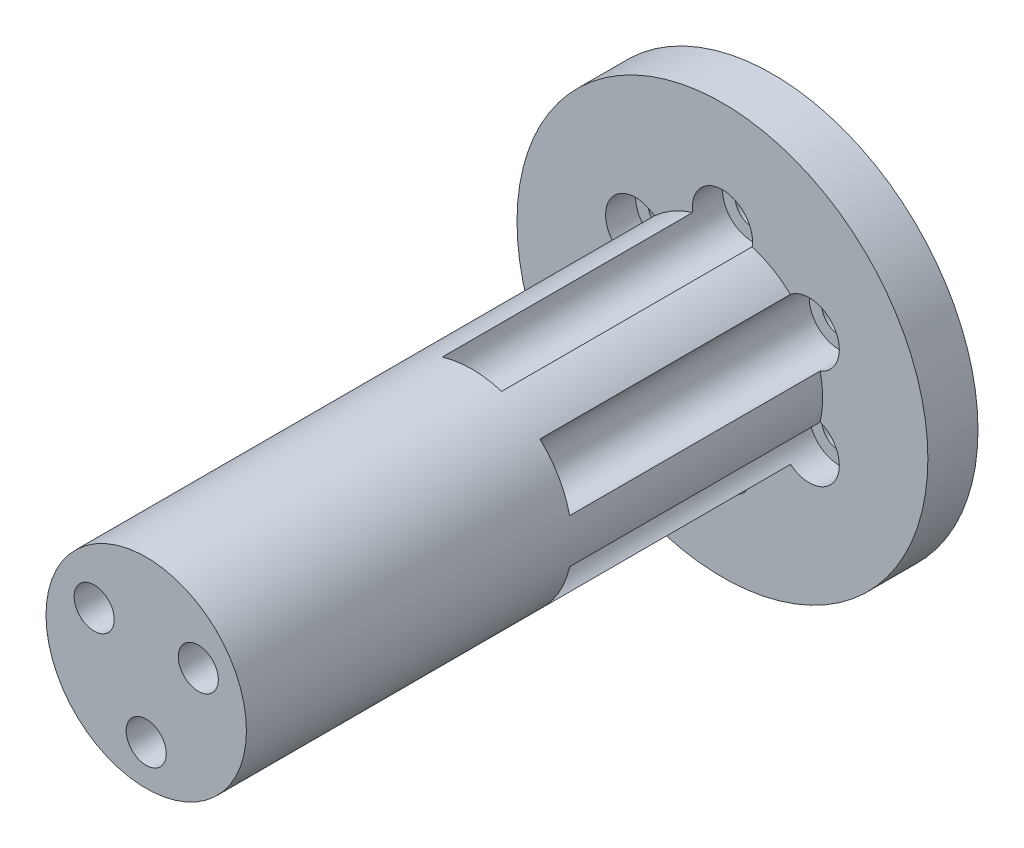
ISO-10303-21;
HEADER;
FILE_DESCRIPTION(('STEP AP214'),'2;1');
FILE_NAME('part.step','',(''),(''),'','','');
FILE_SCHEMA(('AUTOMOTIVE_DESIGN { 1 0 10303 214 1 1 1 1 }'));
ENDSEC;
DATA;
#1=APPLICATION_CONTEXT('core data for automotive mechanical design processes');
#2=APPLICATION_PROTOCOL_DEFINITION('international standard','automotive_design',2000,#1);
#3=PRODUCT_CONTEXT('',#1,'mechanical');
#4=PRODUCT('Part','Part','',(#3));
#5=PRODUCT_RELATED_PRODUCT_CATEGORY('part','',(#4));
#6=PRODUCT_DEFINITION_FORMATION('','',#4);
#7=PRODUCT_DEFINITION_CONTEXT('part definition',#1,'design');
#8=PRODUCT_DEFINITION('design','',#6,#7);
#9=PRODUCT_DEFINITION_SHAPE('','',#8);
#10=(LENGTH_UNIT() NAMED_UNIT(*) SI_UNIT(.MILLI.,.METRE.));
#11=(NAMED_UNIT(*) PLANE_ANGLE_UNIT() SI_UNIT($,.RADIAN.));
#12=(NAMED_UNIT(*) SI_UNIT($,.STERADIAN.) SOLID_ANGLE_UNIT());
#13=UNCERTAINTY_MEASURE_WITH_UNIT(LENGTH_MEASURE(1.E-05),#10,'distance_accuracy_value','');
#14=(GEOMETRIC_REPRESENTATION_CONTEXT(3) GLOBAL_UNCERTAINTY_ASSIGNED_CONTEXT((#13)) GLOBAL_UNIT_ASSIGNED_CONTEXT((#10,
#11,#12)) REPRESENTATION_CONTEXT('',''));
#15=CARTESIAN_POINT('',(0.,0.,0.));
#16=DIRECTION('',(0.,0.,1.));
#17=DIRECTION('',(1.,0.,0.));
#18=AXIS2_PLACEMENT_3D('',#15,#16,#17);
#19=CARTESIAN_POINT('',(-5.19615242270663,3.,46.9));
#20=DIRECTION('',(0.,0.,1.));
#21=DIRECTION('',(1.,0.,0.));
#22=AXIS2_PLACEMENT_3D('',#19,#20,#21);
#23=CYLINDRICAL_SURFACE('',#22,2.);
#24=CARTESIAN_POINT('',(-5.19615242270663,3.,56.5));
#25=DIRECTION('',(0.,0.,1.));
#26=DIRECTION('',(1.,0.,0.));
#27=AXIS2_PLACEMENT_3D('',#24,#25,#26);
#28=CIRCLE('',#27,2.);
#29=CARTESIAN_POINT('',(-3.19615242270663,3.,56.5));
#30=VERTEX_POINT('',#29);
#31=EDGE_CURVE('E314',#30,#30,#28,.T.);
#32=ORIENTED_EDGE('',*,*,#31,.T.);
#33=EDGE_LOOP('',(#32));
#34=FACE_BOUND('',#33,.T.);
#35=CARTESIAN_POINT('',(-5.19615242270663,3.,48.9));
#36=DIRECTION('',(0.,0.,1.));
#37=DIRECTION('',(1.,0.,0.));
#38=AXIS2_PLACEMENT_3D('',#35,#36,#37);
#39=CIRCLE('',#38,2.);
#40=CARTESIAN_POINT('',(-3.19615242270663,3.,48.9));
#41=VERTEX_POINT('',#40);
#42=EDGE_CURVE('E11',#41,#41,#39,.T.);
#43=ORIENTED_EDGE('',*,*,#42,.F.);
#44=EDGE_LOOP('',(#43));
#45=FACE_BOUND('',#44,.T.);
#46=ADVANCED_FACE('F17',(#34,#45),#23,.F.);
#47=CARTESIAN_POINT('',(0.,0.,48.9));
#48=DIRECTION('',(0.,0.,1.));
#49=DIRECTION('',(1.,0.,0.));
#50=AXIS2_PLACEMENT_3D('',#47,#48,#49);
#51=PLANE('',#50);
#52=ORIENTED_EDGE('',*,*,#42,.T.);
#53=EDGE_LOOP('',(#52));
#54=FACE_BOUND('',#53,.T.);
#55=ADVANCED_FACE('F487',(#54),#51,.T.);
#56=CARTESIAN_POINT('',(5.19615242270663,3.,46.9));
#57=DIRECTION('',(0.,0.,1.));
#58=DIRECTION('',(1.,0.,0.));
#59=AXIS2_PLACEMENT_3D('',#56,#57,#58);
#60=CYLINDRICAL_SURFACE('',#59,2.);
#61=CARTESIAN_POINT('',(5.19615242270663,3.,56.5));
#62=DIRECTION('',(0.,0.,1.));
#63=DIRECTION('',(1.,0.,0.));
#64=AXIS2_PLACEMENT_3D('',#61,#62,#63);
#65=CIRCLE('',#64,2.);
#66=CARTESIAN_POINT('',(7.19615242270663,3.,56.5));
#67=VERTEX_POINT('',#66);
#68=EDGE_CURVE('E310',#67,#67,#65,.T.);
#69=ORIENTED_EDGE('',*,*,#68,.T.);
#70=EDGE_LOOP('',(#69));
#71=FACE_BOUND('',#70,.T.);
#72=CARTESIAN_POINT('',(5.19615242270663,3.,48.9));
#73=DIRECTION('',(0.,0.,1.));
#74=DIRECTION('',(1.,0.,0.));
#75=AXIS2_PLACEMENT_3D('',#72,#73,#74);
#76=CIRCLE('',#75,2.);
#77=CARTESIAN_POINT('',(7.19615242270663,3.,48.9));
#78=VERTEX_POINT('',#77);
#79=EDGE_CURVE('E28',#78,#78,#76,.T.);
#80=ORIENTED_EDGE('',*,*,#79,.F.);
#81=EDGE_LOOP('',(#80));
#82=FACE_BOUND('',#81,.T.);
#83=ADVANCED_FACE('F493',(#71,#82),#60,.F.);
#84=CARTESIAN_POINT('',(0.,0.,48.9));
#85=DIRECTION('',(0.,0.,1.));
#86=DIRECTION('',(1.,0.,0.));
#87=AXIS2_PLACEMENT_3D('',#84,#85,#86);
#88=PLANE('',#87);
#89=ORIENTED_EDGE('',*,*,#79,.T.);
#90=EDGE_LOOP('',(#89));
#91=FACE_BOUND('',#90,.T.);
#92=ADVANCED_FACE('F593',(#91),#88,.T.);
#93=CARTESIAN_POINT('',(0.,-6.,46.9));
#94=DIRECTION('',(0.,0.,1.));
#95=DIRECTION('',(1.,0.,0.));
#96=AXIS2_PLACEMENT_3D('',#93,#94,#95);
#97=CYLINDRICAL_SURFACE('',#96,2.);
#98=CARTESIAN_POINT('',(0.,-6.,56.5));
#99=DIRECTION('',(0.,0.,1.));
#100=DIRECTION('',(1.,0.,0.));
#101=AXIS2_PLACEMENT_3D('',#98,#99,#100);
#102=CIRCLE('',#101,2.);
#103=CARTESIAN_POINT('',(2.,-6.,56.5));
#104=VERTEX_POINT('',#103);
#105=EDGE_CURVE('E302',#104,#104,#102,.T.);
#106=ORIENTED_EDGE('',*,*,#105,.T.);
#107=EDGE_LOOP('',(#106));
#108=FACE_BOUND('',#107,.T.);
#109=CARTESIAN_POINT('',(0.,-6.,48.9));
#110=DIRECTION('',(0.,0.,1.));
#111=DIRECTION('',(1.,0.,0.));
#112=AXIS2_PLACEMENT_3D('',#109,#110,#111);
#113=CIRCLE('',#112,2.);
#114=CARTESIAN_POINT('',(2.,-6.,48.9));
#115=VERTEX_POINT('',#114);
#116=EDGE_CURVE('E296',#115,#115,#113,.T.);
#117=ORIENTED_EDGE('',*,*,#116,.F.);
#118=EDGE_LOOP('',(#117));
#119=FACE_BOUND('',#118,.T.);
#120=ADVANCED_FACE('F589',(#108,#119),#97,.F.);
#121=CARTESIAN_POINT('',(0.,0.,48.9));
#122=DIRECTION('',(0.,0.,1.));
#123=DIRECTION('',(1.,0.,0.));
#124=AXIS2_PLACEMENT_3D('',#121,#122,#123);
#125=PLANE('',#124);
#126=ORIENTED_EDGE('',*,*,#116,.T.);
#127=EDGE_LOOP('',(#126));
#128=FACE_BOUND('',#127,.T.);
#129=ADVANCED_FACE('F592',(#128),#125,.T.);
#130=CARTESIAN_POINT('',(68.5000000000137,0.,56.5));
#131=DIRECTION('',(0.,0.,1.));
#132=DIRECTION('',(1.,0.,0.));
#133=AXIS2_PLACEMENT_3D('',#130,#131,#132);
#134=PLANE('',#133);
#135=CARTESIAN_POINT('',(0.,0.,56.5));
#136=DIRECTION('',(0.,0.,1.));
#137=DIRECTION('',(1.,0.,0.));
#138=AXIS2_PLACEMENT_3D('',#135,#136,#137);
#139=CIRCLE('',#138,10.);
#140=CARTESIAN_POINT('',(10.,0.,56.5));
#141=VERTEX_POINT('',#140);
#142=EDGE_CURVE('E237',#141,#141,#139,.T.);
#143=ORIENTED_EDGE('',*,*,#142,.T.);
#144=EDGE_LOOP('',(#143));
#145=FACE_BOUND('',#144,.T.);
#146=ORIENTED_EDGE('',*,*,#105,.F.);
#147=EDGE_LOOP('',(#146));
#148=FACE_BOUND('',#147,.T.);
#149=ORIENTED_EDGE('',*,*,#68,.F.);
#150=EDGE_LOOP('',(#149));
#151=FACE_BOUND('',#150,.T.);
#152=ORIENTED_EDGE('',*,*,#31,.F.);
#153=EDGE_LOOP('',(#152));
#154=FACE_BOUND('',#153,.T.);
#155=ADVANCED_FACE('F597',(#145,#148,#151,#154),#134,.T.);
#156=CARTESIAN_POINT('',(0.,0.,24.));
#157=DIRECTION('',(0.,0.,1.));
#158=DIRECTION('',(1.,0.,0.));
#159=AXIS2_PLACEMENT_3D('',#156,#157,#158);
#160=PLANE('',#159);
#161=CARTESIAN_POINT('',(0.,0.,24.));
#162=DIRECTION('',(0.,0.,1.));
#163=DIRECTION('',(1.,0.,0.));
#164=AXIS2_PLACEMENT_3D('',#161,#162,#163);
#165=CIRCLE('',#164,10.);
#166=CARTESIAN_POINT('',(-6.787513611145,7.34368156843156,24.));
#167=VERTEX_POINT('',#166);
#168=CARTESIAN_POINT('',(-9.75357160113778,2.20631843156845,24.));
#169=VERTEX_POINT('',#168);
#170=EDGE_CURVE('E21',#167,#169,#165,.T.);
#171=ORIENTED_EDGE('',*,*,#170,.F.);
#172=CARTESIAN_POINT('',(-8.66025403784439,5.,24.));
#173=DIRECTION('',(0.,0.,1.));
#174=DIRECTION('',(1.,0.,0.));
#175=AXIS2_PLACEMENT_3D('',#172,#173,#174);
#176=CIRCLE('',#175,3.);
#177=EDGE_CURVE('E252',#169,#167,#176,.T.);
#178=ORIENTED_EDGE('',*,*,#177,.F.);
#179=EDGE_LOOP('',(#171,#178));
#180=FACE_BOUND('',#179,.T.);
#181=ADVANCED_FACE('F598',(#180),#160,.F.);
#182=CARTESIAN_POINT('',(0.,0.,24.));
#183=DIRECTION('',(0.,0.,1.));
#184=DIRECTION('',(1.,0.,0.));
#185=AXIS2_PLACEMENT_3D('',#182,#183,#184);
#186=PLANE('',#185);
#187=CARTESIAN_POINT('',(0.,0.,24.));
#188=DIRECTION('',(0.,0.,1.));
#189=DIRECTION('',(1.,0.,0.));
#190=AXIS2_PLACEMENT_3D('',#187,#188,#189);
#191=CIRCLE('',#190,10.);
#192=CARTESIAN_POINT('',(-9.75357160113778,-2.20631843156845,24.));
#193=VERTEX_POINT('',#192);
#194=CARTESIAN_POINT('',(-6.787513611145,-7.34368156843156,24.));
#195=VERTEX_POINT('',#194);
#196=EDGE_CURVE('E283',#193,#195,#191,.T.);
#197=ORIENTED_EDGE('',*,*,#196,.F.);
#198=CARTESIAN_POINT('',(-8.66025403784439,-5.,24.));
#199=DIRECTION('',(0.,0.,1.));
#200=DIRECTION('',(1.,0.,0.));
#201=AXIS2_PLACEMENT_3D('',#198,#199,#200);
#202=CIRCLE('',#201,3.);
#203=EDGE_CURVE('E279',#195,#193,#202,.T.);
#204=ORIENTED_EDGE('',*,*,#203,.F.);
#205=EDGE_LOOP('',(#197,#204));
#206=FACE_BOUND('',#205,.T.);
#207=ADVANCED_FACE('F600',(#206),#186,.F.);
#208=CARTESIAN_POINT('',(0.,0.,24.));
#209=DIRECTION('',(0.,0.,1.));
#210=DIRECTION('',(1.,0.,0.));
#211=AXIS2_PLACEMENT_3D('',#208,#209,#210);
#212=PLANE('',#211);
#213=CARTESIAN_POINT('',(0.,0.,24.));
#214=DIRECTION('',(0.,0.,1.));
#215=DIRECTION('',(1.,0.,0.));
#216=AXIS2_PLACEMENT_3D('',#213,#214,#215);
#217=CIRCLE('',#216,10.);
#218=CARTESIAN_POINT('',(-2.96605798999278,-9.55,24.));
#219=VERTEX_POINT('',#218);
#220=CARTESIAN_POINT('',(2.96605798999278,-9.55,24.));
#221=VERTEX_POINT('',#220);
#222=EDGE_CURVE('E439',#219,#221,#217,.T.);
#223=ORIENTED_EDGE('',*,*,#222,.F.);
#224=CARTESIAN_POINT('',(0.,-10.,24.));
#225=DIRECTION('',(0.,0.,1.));
#226=DIRECTION('',(1.,0.,0.));
#227=AXIS2_PLACEMENT_3D('',#224,#225,#226);
#228=CIRCLE('',#227,3.);
#229=EDGE_CURVE('E365',#221,#219,#228,.T.);
#230=ORIENTED_EDGE('',*,*,#229,.F.);
#231=EDGE_LOOP('',(#223,#230));
#232=FACE_BOUND('',#231,.T.);
#233=ADVANCED_FACE('F603',(#232),#212,.F.);
#234=CARTESIAN_POINT('',(0.,0.,24.));
#235=DIRECTION('',(0.,0.,1.));
#236=DIRECTION('',(1.,0.,0.));
#237=AXIS2_PLACEMENT_3D('',#234,#235,#236);
#238=PLANE('',#237);
#239=CARTESIAN_POINT('',(0.,0.,24.));
#240=DIRECTION('',(0.,0.,1.));
#241=DIRECTION('',(1.,0.,0.));
#242=AXIS2_PLACEMENT_3D('',#239,#240,#241);
#243=CIRCLE('',#242,10.);
#244=CARTESIAN_POINT('',(6.787513611145,-7.34368156843155,24.));
#245=VERTEX_POINT('',#244);
#246=CARTESIAN_POINT('',(9.75357160113778,-2.20631843156844,24.));
#247=VERTEX_POINT('',#246);
#248=EDGE_CURVE('E291',#245,#247,#243,.T.);
#249=ORIENTED_EDGE('',*,*,#248,.F.);
#250=CARTESIAN_POINT('',(8.66025403784439,-5.,24.));
#251=DIRECTION('',(0.,0.,1.));
#252=DIRECTION('',(1.,0.,0.));
#253=AXIS2_PLACEMENT_3D('',#250,#251,#252);
#254=CIRCLE('',#253,3.);
#255=EDGE_CURVE('E236',#247,#245,#254,.T.);
#256=ORIENTED_EDGE('',*,*,#255,.F.);
#257=EDGE_LOOP('',(#249,#256));
#258=FACE_BOUND('',#257,.T.);
#259=ADVANCED_FACE('F606',(#258),#238,.F.);
#260=CARTESIAN_POINT('',(0.,0.,24.));
#261=DIRECTION('',(0.,0.,1.));
#262=DIRECTION('',(1.,0.,0.));
#263=AXIS2_PLACEMENT_3D('',#260,#261,#262);
#264=PLANE('',#263);
#265=CARTESIAN_POINT('',(0.,0.,24.));
#266=DIRECTION('',(0.,0.,1.));
#267=DIRECTION('',(1.,0.,0.));
#268=AXIS2_PLACEMENT_3D('',#265,#266,#267);
#269=CIRCLE('',#268,10.);
#270=CARTESIAN_POINT('',(9.75357160113778,2.20631843156845,24.));
#271=VERTEX_POINT('',#270);
#272=CARTESIAN_POINT('',(6.787513611145,7.34368156843156,24.));
#273=VERTEX_POINT('',#272);
#274=EDGE_CURVE('E259',#271,#273,#269,.T.);
#275=ORIENTED_EDGE('',*,*,#274,.F.);
#276=CARTESIAN_POINT('',(8.66025403784439,5.,24.));
#277=DIRECTION('',(0.,0.,1.));
#278=DIRECTION('',(1.,0.,0.));
#279=AXIS2_PLACEMENT_3D('',#276,#277,#278);
#280=CIRCLE('',#279,3.);
#281=EDGE_CURVE('E278',#273,#271,#280,.T.);
#282=ORIENTED_EDGE('',*,*,#281,.F.);
#283=EDGE_LOOP('',(#275,#282));
#284=FACE_BOUND('',#283,.T.);
#285=ADVANCED_FACE('F567',(#284),#264,.F.);
#286=CARTESIAN_POINT('',(0.,0.,24.));
#287=DIRECTION('',(0.,0.,1.));
#288=DIRECTION('',(1.,0.,0.));
#289=AXIS2_PLACEMENT_3D('',#286,#287,#288);
#290=PLANE('',#289);
#291=CARTESIAN_POINT('',(0.,0.,24.));
#292=DIRECTION('',(0.,0.,1.));
#293=DIRECTION('',(1.,0.,0.));
#294=AXIS2_PLACEMENT_3D('',#291,#292,#293);
#295=CIRCLE('',#294,10.);
#296=CARTESIAN_POINT('',(2.96605798999278,9.55,24.));
#297=VERTEX_POINT('',#296);
#298=CARTESIAN_POINT('',(-2.96605798999278,9.55,24.));
#299=VERTEX_POINT('',#298);
#300=EDGE_CURVE('E329',#297,#299,#295,.T.);
#301=ORIENTED_EDGE('',*,*,#300,.F.);
#302=CARTESIAN_POINT('',(0.,10.,24.));
#303=DIRECTION('',(0.,0.,1.));
#304=DIRECTION('',(1.,0.,0.));
#305=AXIS2_PLACEMENT_3D('',#302,#303,#304);
#306=CIRCLE('',#305,3.);
#307=EDGE_CURVE('E266',#299,#297,#306,.T.);
#308=ORIENTED_EDGE('',*,*,#307,.F.);
#309=EDGE_LOOP('',(#301,#308));
#310=FACE_BOUND('',#309,.T.);
#311=ADVANCED_FACE('F563',(#310),#290,.F.);
#312=CARTESIAN_POINT('',(8.66025403784439,5.,-4.));
#313=DIRECTION('',(0.,0.,1.));
#314=DIRECTION('',(1.,0.,0.));
#315=AXIS2_PLACEMENT_3D('',#312,#313,#314);
#316=CYLINDRICAL_SURFACE('',#315,3.);
#317=CARTESIAN_POINT('',(8.66025403784439,5.,-1.));
#318=DIRECTION('',(0.,0.,1.));
#319=DIRECTION('',(1.,0.,0.));
#320=AXIS2_PLACEMENT_3D('',#317,#318,#319);
#321=CIRCLE('',#320,3.);
#322=CARTESIAN_POINT('',(9.75357160113778,2.20631843156845,-1.));
#323=VERTEX_POINT('',#322);
#324=CARTESIAN_POINT('',(6.787513611145,7.34368156843156,-1.));
#325=VERTEX_POINT('',#324);
#326=EDGE_CURVE('E337',#323,#325,#321,.T.);
#327=ORIENTED_EDGE('',*,*,#326,.T.);
#328=DIRECTION('',(0.,0.,-1.));
#329=VECTOR('',#328,1.);
#330=CARTESIAN_POINT('',(6.787513611145,7.34368156843156,24.));
#331=LINE('',#330,#329);
#332=EDGE_CURVE('E330',#273,#325,#331,.T.);
#333=ORIENTED_EDGE('',*,*,#332,.F.);
#334=ORIENTED_EDGE('',*,*,#281,.T.);
#335=DIRECTION('',(0.,0.,-1.));
#336=VECTOR('',#335,1.);
#337=CARTESIAN_POINT('',(9.75357160113778,2.20631843156845,24.));
#338=LINE('',#337,#336);
#339=EDGE_CURVE('E256',#271,#323,#338,.T.);
#340=ORIENTED_EDGE('',*,*,#339,.T.);
#341=EDGE_LOOP('',(#327,#333,#334,#340));
#342=FACE_BOUND('',#341,.T.);
#343=CARTESIAN_POINT('',(8.66025403784439,5.,-4.));
#344=DIRECTION('',(0.,0.,1.));
#345=DIRECTION('',(1.,0.,0.));
#346=AXIS2_PLACEMENT_3D('',#343,#344,#345);
#347=CIRCLE('',#346,3.);
#348=CARTESIAN_POINT('',(11.6602540378444,5.,-4.));
#349=VERTEX_POINT('',#348);
#350=EDGE_CURVE('E270',#349,#349,#347,.T.);
#351=ORIENTED_EDGE('',*,*,#350,.F.);
#352=EDGE_LOOP('',(#351));
#353=FACE_BOUND('',#352,.T.);
#354=ADVANCED_FACE('F566',(#342,#353),#316,.F.);
#355=CARTESIAN_POINT('',(0.,0.,-4.));
#356=DIRECTION('',(0.,0.,1.));
#357=DIRECTION('',(1.,0.,0.));
#358=AXIS2_PLACEMENT_3D('',#355,#356,#357);
#359=PLANE('',#358);
#360=CARTESIAN_POINT('',(8.66025403784439,5.,-4.));
#361=DIRECTION('',(0.,0.,-1.));
#362=DIRECTION('',(1.,0.,0.));
#363=AXIS2_PLACEMENT_3D('',#360,#361,#362);
#364=CIRCLE('',#363,1.75);
#365=CARTESIAN_POINT('',(10.4102540378444,5.,-4.));
#366=VERTEX_POINT('',#365);
#367=EDGE_CURVE('E345',#366,#366,#364,.T.);
#368=ORIENTED_EDGE('',*,*,#367,.T.);
#369=EDGE_LOOP('',(#368));
#370=FACE_BOUND('',#369,.T.);
#371=ORIENTED_EDGE('',*,*,#350,.T.);
#372=EDGE_LOOP('',(#371));
#373=FACE_BOUND('',#372,.T.);
#374=ADVANCED_FACE('F510',(#370,#373),#359,.T.);
#375=CARTESIAN_POINT('',(0.,10.,-4.));
#376=DIRECTION('',(0.,0.,1.));
#377=DIRECTION('',(1.,0.,0.));
#378=AXIS2_PLACEMENT_3D('',#375,#376,#377);
#379=CYLINDRICAL_SURFACE('',#378,3.);
#380=CARTESIAN_POINT('',(0.,10.,-1.));
#381=DIRECTION('',(0.,0.,1.));
#382=DIRECTION('',(1.,0.,0.));
#383=AXIS2_PLACEMENT_3D('',#380,#381,#382);
#384=CIRCLE('',#383,3.);
#385=CARTESIAN_POINT('',(2.96605798999278,9.55,-1.));
#386=VERTEX_POINT('',#385);
#387=CARTESIAN_POINT('',(-2.96605798999278,9.55,-1.));
#388=VERTEX_POINT('',#387);
#389=EDGE_CURVE('E359',#386,#388,#384,.T.);
#390=ORIENTED_EDGE('',*,*,#389,.T.);
#391=DIRECTION('',(0.,0.,-1.));
#392=VECTOR('',#391,1.);
#393=CARTESIAN_POINT('',(-2.96605798999278,9.55,24.));
#394=LINE('',#393,#392);
#395=EDGE_CURVE('E355',#299,#388,#394,.T.);
#396=ORIENTED_EDGE('',*,*,#395,.F.);
#397=ORIENTED_EDGE('',*,*,#307,.T.);
#398=DIRECTION('',(0.,0.,-1.));
#399=VECTOR('',#398,1.);
#400=CARTESIAN_POINT('',(2.96605798999278,9.55,24.));
#401=LINE('',#400,#399);
#402=EDGE_CURVE('E326',#297,#386,#401,.T.);
#403=ORIENTED_EDGE('',*,*,#402,.T.);
#404=EDGE_LOOP('',(#390,#396,#397,#403));
#405=FACE_BOUND('',#404,.T.);
#406=CARTESIAN_POINT('',(0.,10.,-4.));
#407=DIRECTION('',(0.,0.,1.));
#408=DIRECTION('',(1.,0.,0.));
#409=AXIS2_PLACEMENT_3D('',#406,#407,#408);
#410=CIRCLE('',#409,3.);
#411=CARTESIAN_POINT('',(3.,10.,-4.));
#412=VERTEX_POINT('',#411);
#413=EDGE_CURVE('E254',#412,#412,#410,.T.);
#414=ORIENTED_EDGE('',*,*,#413,.F.);
#415=EDGE_LOOP('',(#414));
#416=FACE_BOUND('',#415,.T.);
#417=ADVANCED_FACE('F501',(#405,#416),#379,.F.);
#418=CARTESIAN_POINT('',(0.,0.,-4.));
#419=DIRECTION('',(0.,0.,1.));
#420=DIRECTION('',(1.,0.,0.));
#421=AXIS2_PLACEMENT_3D('',#418,#419,#420);
#422=PLANE('',#421);
#423=CARTESIAN_POINT('',(0.,10.,-4.));
#424=DIRECTION('',(0.,0.,-1.));
#425=DIRECTION('',(1.,0.,0.));
#426=AXIS2_PLACEMENT_3D('',#423,#424,#425);
#427=CIRCLE('',#426,1.75);
#428=CARTESIAN_POINT('',(1.75,10.,-4.));
#429=VERTEX_POINT('',#428);
#430=EDGE_CURVE('E261',#429,#429,#427,.T.);
#431=ORIENTED_EDGE('',*,*,#430,.T.);
#432=EDGE_LOOP('',(#431));
#433=FACE_BOUND('',#432,.T.);
#434=ORIENTED_EDGE('',*,*,#413,.T.);
#435=EDGE_LOOP('',(#434));
#436=FACE_BOUND('',#435,.T.);
#437=ADVANCED_FACE('F498',(#433,#436),#422,.T.);
#438=CARTESIAN_POINT('',(-8.66025403784439,5.,-4.));
#439=DIRECTION('',(0.,0.,1.));
#440=DIRECTION('',(1.,0.,0.));
#441=AXIS2_PLACEMENT_3D('',#438,#439,#440);
#442=CYLINDRICAL_SURFACE('',#441,3.);
#443=CARTESIAN_POINT('',(-8.66025403784439,5.,-1.));
#444=DIRECTION('',(0.,0.,1.));
#445=DIRECTION('',(1.,0.,0.));
#446=AXIS2_PLACEMENT_3D('',#443,#444,#445);
#447=CIRCLE('',#446,3.);
#448=CARTESIAN_POINT('',(-6.787513611145,7.34368156843156,-1.));
#449=VERTEX_POINT('',#448);
#450=CARTESIAN_POINT('',(-9.75357160113778,2.20631843156845,-1.));
#451=VERTEX_POINT('',#450);
#452=EDGE_CURVE('E331',#449,#451,#447,.T.);
#453=ORIENTED_EDGE('',*,*,#452,.T.);
#454=DIRECTION('',(0.,0.,-1.));
#455=VECTOR('',#454,1.);
#456=CARTESIAN_POINT('',(-9.75357160113778,2.20631843156845,24.));
#457=LINE('',#456,#455);
#458=EDGE_CURVE('E398',#169,#451,#457,.T.);
#459=ORIENTED_EDGE('',*,*,#458,.F.);
#460=ORIENTED_EDGE('',*,*,#177,.T.);
#461=DIRECTION('',(0.,0.,-1.));
#462=VECTOR('',#461,1.);
#463=CARTESIAN_POINT('',(-6.787513611145,7.34368156843156,24.));
#464=LINE('',#463,#462);
#465=EDGE_CURVE('E246',#167,#449,#464,.T.);
#466=ORIENTED_EDGE('',*,*,#465,.T.);
#467=EDGE_LOOP('',(#453,#459,#460,#466));
#468=FACE_BOUND('',#467,.T.);
#469=CARTESIAN_POINT('',(-8.66025403784439,5.,-4.));
#470=DIRECTION('',(0.,0.,1.));
#471=DIRECTION('',(1.,0.,0.));
#472=AXIS2_PLACEMENT_3D('',#469,#470,#471);
#473=CIRCLE('',#472,3.);
#474=CARTESIAN_POINT('',(-5.66025403784439,5.,-4.));
#475=VERTEX_POINT('',#474);
#476=EDGE_CURVE('E255',#475,#475,#473,.T.);
#477=ORIENTED_EDGE('',*,*,#476,.F.);
#478=EDGE_LOOP('',(#477));
#479=FACE_BOUND('',#478,.T.);
#480=ADVANCED_FACE('F500',(#468,#479),#442,.F.);
#481=CARTESIAN_POINT('',(0.,0.,-4.));
#482=DIRECTION('',(0.,0.,1.));
#483=DIRECTION('',(1.,0.,0.));
#484=AXIS2_PLACEMENT_3D('',#481,#482,#483);
#485=PLANE('',#484);
#486=CARTESIAN_POINT('',(-8.66025403784439,5.,-4.));
#487=DIRECTION('',(0.,0.,-1.));
#488=DIRECTION('',(1.,0.,0.));
#489=AXIS2_PLACEMENT_3D('',#486,#487,#488);
#490=CIRCLE('',#489,1.75);
#491=CARTESIAN_POINT('',(-6.91025403784439,5.,-4.));
#492=VERTEX_POINT('',#491);
#493=EDGE_CURVE('E316',#492,#492,#490,.T.);
#494=ORIENTED_EDGE('',*,*,#493,.T.);
#495=EDGE_LOOP('',(#494));
#496=FACE_BOUND('',#495,.T.);
#497=ORIENTED_EDGE('',*,*,#476,.T.);
#498=EDGE_LOOP('',(#497));
#499=FACE_BOUND('',#498,.T.);
#500=ADVANCED_FACE('F507',(#496,#499),#485,.T.);
#501=CARTESIAN_POINT('',(-8.66025403784439,-5.,-4.));
#502=DIRECTION('',(0.,0.,1.));
#503=DIRECTION('',(1.,0.,0.));
#504=AXIS2_PLACEMENT_3D('',#501,#502,#503);
#505=CYLINDRICAL_SURFACE('',#504,3.);
#506=CARTESIAN_POINT('',(-8.66025403784439,-5.,-1.));
#507=DIRECTION('',(0.,0.,1.));
#508=DIRECTION('',(1.,0.,0.));
#509=AXIS2_PLACEMENT_3D('',#506,#507,#508);
#510=CIRCLE('',#509,3.);
#511=CARTESIAN_POINT('',(-9.75357160113778,-2.20631843156845,-1.));
#512=VERTEX_POINT('',#511);
#513=CARTESIAN_POINT('',(-6.787513611145,-7.34368156843156,-1.));
#514=VERTEX_POINT('',#513);
#515=EDGE_CURVE('E388',#512,#514,#510,.T.);
#516=ORIENTED_EDGE('',*,*,#515,.T.);
#517=DIRECTION('',(0.,0.,-1.));
#518=VECTOR('',#517,1.);
#519=CARTESIAN_POINT('',(-6.787513611145,-7.34368156843156,24.));
#520=LINE('',#519,#518);
#521=EDGE_CURVE('E287',#195,#514,#520,.T.);
#522=ORIENTED_EDGE('',*,*,#521,.F.);
#523=ORIENTED_EDGE('',*,*,#203,.T.);
#524=DIRECTION('',(0.,0.,-1.));
#525=VECTOR('',#524,1.);
#526=CARTESIAN_POINT('',(-9.75357160113778,-2.20631843156845,24.));
#527=LINE('',#526,#525);
#528=EDGE_CURVE('E288',#193,#512,#527,.T.);
#529=ORIENTED_EDGE('',*,*,#528,.T.);
#530=EDGE_LOOP('',(#516,#522,#523,#529));
#531=FACE_BOUND('',#530,.T.);
#532=CARTESIAN_POINT('',(-8.66025403784439,-5.,-4.));
#533=DIRECTION('',(0.,0.,1.));
#534=DIRECTION('',(1.,0.,0.));
#535=AXIS2_PLACEMENT_3D('',#532,#533,#534);
#536=CIRCLE('',#535,3.);
#537=CARTESIAN_POINT('',(-5.66025403784439,-5.,-4.));
#538=VERTEX_POINT('',#537);
#539=EDGE_CURVE('E282',#538,#538,#536,.T.);
#540=ORIENTED_EDGE('',*,*,#539,.F.);
#541=EDGE_LOOP('',(#540));
#542=FACE_BOUND('',#541,.T.);
#543=ADVANCED_FACE('F481',(#531,#542),#505,.F.);
#544=CARTESIAN_POINT('',(0.,0.,-4.));
#545=DIRECTION('',(0.,0.,1.));
#546=DIRECTION('',(1.,0.,0.));
#547=AXIS2_PLACEMENT_3D('',#544,#545,#546);
#548=PLANE('',#547);
#549=CARTESIAN_POINT('',(-8.66025403784439,-5.,-4.));
#550=DIRECTION('',(0.,0.,-1.));
#551=DIRECTION('',(1.,0.,0.));
#552=AXIS2_PLACEMENT_3D('',#549,#550,#551);
#553=CIRCLE('',#552,1.75);
#554=CARTESIAN_POINT('',(-6.91025403784439,-5.,-4.));
#555=VERTEX_POINT('',#554);
#556=EDGE_CURVE('E275',#555,#555,#553,.T.);
#557=ORIENTED_EDGE('',*,*,#556,.T.);
#558=EDGE_LOOP('',(#557));
#559=FACE_BOUND('',#558,.T.);
#560=ORIENTED_EDGE('',*,*,#539,.T.);
#561=EDGE_LOOP('',(#560));
#562=FACE_BOUND('',#561,.T.);
#563=ADVANCED_FACE('F471',(#559,#562),#548,.T.);
#564=CARTESIAN_POINT('',(0.,-10.,-4.));
#565=DIRECTION('',(0.,0.,1.));
#566=DIRECTION('',(1.,0.,0.));
#567=AXIS2_PLACEMENT_3D('',#564,#565,#566);
#568=CYLINDRICAL_SURFACE('',#567,3.);
#569=CARTESIAN_POINT('',(0.,-10.,-1.));
#570=DIRECTION('',(0.,0.,1.));
#571=DIRECTION('',(1.,0.,0.));
#572=AXIS2_PLACEMENT_3D('',#569,#570,#571);
#573=CIRCLE('',#572,3.);
#574=CARTESIAN_POINT('',(-2.96605798999278,-9.55,-1.));
#575=VERTEX_POINT('',#574);
#576=CARTESIAN_POINT('',(2.96605798999278,-9.55,-1.));
#577=VERTEX_POINT('',#576);
#578=EDGE_CURVE('E404',#575,#577,#573,.T.);
#579=ORIENTED_EDGE('',*,*,#578,.T.);
#580=DIRECTION('',(0.,0.,-1.));
#581=VECTOR('',#580,1.);
#582=CARTESIAN_POINT('',(2.96605798999278,-9.55,24.));
#583=LINE('',#582,#581);
#584=EDGE_CURVE('E387',#221,#577,#583,.T.);
#585=ORIENTED_EDGE('',*,*,#584,.F.);
#586=ORIENTED_EDGE('',*,*,#229,.T.);
#587=DIRECTION('',(0.,0.,-1.));
#588=VECTOR('',#587,1.);
#589=CARTESIAN_POINT('',(-2.96605798999278,-9.55,24.));
#590=LINE('',#589,#588);
#591=EDGE_CURVE('E250',#219,#575,#590,.T.);
#592=ORIENTED_EDGE('',*,*,#591,.T.);
#593=EDGE_LOOP('',(#579,#585,#586,#592));
#594=FACE_BOUND('',#593,.T.);
#595=CARTESIAN_POINT('',(0.,-10.,-4.));
#596=DIRECTION('',(0.,0.,1.));
#597=DIRECTION('',(1.,0.,0.));
#598=AXIS2_PLACEMENT_3D('',#595,#596,#597);
#599=CIRCLE('',#598,3.);
#600=CARTESIAN_POINT('',(3.,-10.,-4.));
#601=VERTEX_POINT('',#600);
#602=EDGE_CURVE('E243',#601,#601,#599,.T.);
#603=ORIENTED_EDGE('',*,*,#602,.F.);
#604=EDGE_LOOP('',(#603));
#605=FACE_BOUND('',#604,.T.);
#606=ADVANCED_FACE('F469',(#594,#605),#568,.F.);
#607=CARTESIAN_POINT('',(0.,0.,-4.));
#608=DIRECTION('',(0.,0.,1.));
#609=DIRECTION('',(1.,0.,0.));
#610=AXIS2_PLACEMENT_3D('',#607,#608,#609);
#611=PLANE('',#610);
#612=CARTESIAN_POINT('',(0.,-10.,-4.));
#613=DIRECTION('',(0.,0.,-1.));
#614=DIRECTION('',(1.,0.,0.));
#615=AXIS2_PLACEMENT_3D('',#612,#613,#614);
#616=CIRCLE('',#615,1.75);
#617=CARTESIAN_POINT('',(1.75,-10.,-4.));
#618=VERTEX_POINT('',#617);
#619=EDGE_CURVE('E274',#618,#618,#616,.T.);
#620=ORIENTED_EDGE('',*,*,#619,.T.);
#621=EDGE_LOOP('',(#620));
#622=FACE_BOUND('',#621,.T.);
#623=ORIENTED_EDGE('',*,*,#602,.T.);
#624=EDGE_LOOP('',(#623));
#625=FACE_BOUND('',#624,.T.);
#626=ADVANCED_FACE('F467',(#622,#625),#611,.T.);
#627=CARTESIAN_POINT('',(8.66025403784439,-5.,-4.));
#628=DIRECTION('',(0.,0.,1.));
#629=DIRECTION('',(1.,0.,0.));
#630=AXIS2_PLACEMENT_3D('',#627,#628,#629);
#631=CYLINDRICAL_SURFACE('',#630,3.);
#632=CARTESIAN_POINT('',(8.66025403784439,-5.,-1.));
#633=DIRECTION('',(0.,0.,1.));
#634=DIRECTION('',(1.,0.,0.));
#635=AXIS2_PLACEMENT_3D('',#632,#633,#634);
#636=CIRCLE('',#635,3.);
#637=CARTESIAN_POINT('',(6.787513611145,-7.34368156843155,-1.));
#638=VERTEX_POINT('',#637);
#639=CARTESIAN_POINT('',(9.75357160113778,-2.20631843156844,-1.));
#640=VERTEX_POINT('',#639);
#641=EDGE_CURVE('E294',#638,#640,#636,.T.);
#642=ORIENTED_EDGE('',*,*,#641,.T.);
#643=DIRECTION('',(0.,0.,-1.));
#644=VECTOR('',#643,1.);
#645=CARTESIAN_POINT('',(9.75357160113778,-2.20631843156844,24.));
#646=LINE('',#645,#644);
#647=EDGE_CURVE('E260',#247,#640,#646,.T.);
#648=ORIENTED_EDGE('',*,*,#647,.F.);
#649=ORIENTED_EDGE('',*,*,#255,.T.);
#650=DIRECTION('',(0.,0.,-1.));
#651=VECTOR('',#650,1.);
#652=CARTESIAN_POINT('',(6.787513611145,-7.34368156843155,24.));
#653=LINE('',#652,#651);
#654=EDGE_CURVE('E384',#245,#638,#653,.T.);
#655=ORIENTED_EDGE('',*,*,#654,.T.);
#656=EDGE_LOOP('',(#642,#648,#649,#655));
#657=FACE_BOUND('',#656,.T.);
#658=CARTESIAN_POINT('',(8.66025403784439,-5.,-4.));
#659=DIRECTION('',(0.,0.,1.));
#660=DIRECTION('',(1.,0.,0.));
#661=AXIS2_PLACEMENT_3D('',#658,#659,#660);
#662=CIRCLE('',#661,3.);
#663=CARTESIAN_POINT('',(11.6602540378444,-5.,-4.));
#664=VERTEX_POINT('',#663);
#665=EDGE_CURVE('E232',#664,#664,#662,.T.);
#666=ORIENTED_EDGE('',*,*,#665,.F.);
#667=EDGE_LOOP('',(#666));
#668=FACE_BOUND('',#667,.T.);
#669=ADVANCED_FACE('F418',(#657,#668),#631,.F.);
#670=CARTESIAN_POINT('',(0.,0.,-4.));
#671=DIRECTION('',(0.,0.,1.));
#672=DIRECTION('',(1.,0.,0.));
#673=AXIS2_PLACEMENT_3D('',#670,#671,#672);
#674=PLANE('',#673);
#675=CARTESIAN_POINT('',(8.66025403784439,-5.,-4.));
#676=DIRECTION('',(0.,0.,-1.));
#677=DIRECTION('',(1.,0.,0.));
#678=AXIS2_PLACEMENT_3D('',#675,#676,#677);
#679=CIRCLE('',#678,1.75);
#680=CARTESIAN_POINT('',(10.4102540378444,-5.,-4.));
#681=VERTEX_POINT('',#680);
#682=EDGE_CURVE('E325',#681,#681,#679,.T.);
#683=ORIENTED_EDGE('',*,*,#682,.T.);
#684=EDGE_LOOP('',(#683));
#685=FACE_BOUND('',#684,.T.);
#686=ORIENTED_EDGE('',*,*,#665,.T.);
#687=EDGE_LOOP('',(#686));
#688=FACE_BOUND('',#687,.T.);
#689=ADVANCED_FACE('F233',(#685,#688),#674,.T.);
#690=CARTESIAN_POINT('',(0.,0.,53.002));
#691=DIRECTION('',(0.,0.,-1.));
#692=DIRECTION('',(-1.,0.,0.));
#693=AXIS2_PLACEMENT_3D('',#690,#691,#692);
#694=CYLINDRICAL_SURFACE('',#693,10.);
#695=ORIENTED_EDGE('',*,*,#142,.F.);
#696=EDGE_LOOP('',(#695));
#697=FACE_BOUND('',#696,.T.);
#698=ORIENTED_EDGE('',*,*,#170,.T.);
#699=ORIENTED_EDGE('',*,*,#458,.T.);
#700=CARTESIAN_POINT('',(0.,0.,-1.));
#701=DIRECTION('',(0.,0.,1.));
#702=DIRECTION('',(1.,0.,0.));
#703=AXIS2_PLACEMENT_3D('',#700,#701,#702);
#704=CIRCLE('',#703,10.);
#705=EDGE_CURVE('E336',#451,#512,#704,.T.);
#706=ORIENTED_EDGE('',*,*,#705,.T.);
#707=ORIENTED_EDGE('',*,*,#528,.F.);
#708=ORIENTED_EDGE('',*,*,#196,.T.);
#709=ORIENTED_EDGE('',*,*,#521,.T.);
#710=CARTESIAN_POINT('',(0.,0.,-1.));
#711=DIRECTION('',(0.,0.,1.));
#712=DIRECTION('',(1.,0.,0.));
#713=AXIS2_PLACEMENT_3D('',#710,#711,#712);
#714=CIRCLE('',#713,10.);
#715=EDGE_CURVE('E392',#514,#575,#714,.T.);
#716=ORIENTED_EDGE('',*,*,#715,.T.);
#717=ORIENTED_EDGE('',*,*,#591,.F.);
#718=ORIENTED_EDGE('',*,*,#222,.T.);
#719=ORIENTED_EDGE('',*,*,#584,.T.);
#720=CARTESIAN_POINT('',(0.,0.,-1.));
#721=DIRECTION('',(0.,0.,1.));
#722=DIRECTION('',(1.,0.,0.));
#723=AXIS2_PLACEMENT_3D('',#720,#721,#722);
#724=CIRCLE('',#723,10.);
#725=EDGE_CURVE('E401',#577,#638,#724,.T.);
#726=ORIENTED_EDGE('',*,*,#725,.T.);
#727=ORIENTED_EDGE('',*,*,#654,.F.);
#728=ORIENTED_EDGE('',*,*,#248,.T.);
#729=ORIENTED_EDGE('',*,*,#647,.T.);
#730=CARTESIAN_POINT('',(0.,0.,-1.));
#731=DIRECTION('',(0.,0.,1.));
#732=DIRECTION('',(1.,0.,0.));
#733=AXIS2_PLACEMENT_3D('',#730,#731,#732);
#734=CIRCLE('',#733,10.);
#735=EDGE_CURVE('E341',#640,#323,#734,.T.);
#736=ORIENTED_EDGE('',*,*,#735,.T.);
#737=ORIENTED_EDGE('',*,*,#339,.F.);
#738=ORIENTED_EDGE('',*,*,#274,.T.);
#739=ORIENTED_EDGE('',*,*,#332,.T.);
#740=CARTESIAN_POINT('',(0.,0.,-1.));
#741=DIRECTION('',(0.,0.,1.));
#742=DIRECTION('',(1.,0.,0.));
#743=AXIS2_PLACEMENT_3D('',#740,#741,#742);
#744=CIRCLE('',#743,10.);
#745=EDGE_CURVE('E342',#325,#386,#744,.T.);
#746=ORIENTED_EDGE('',*,*,#745,.T.);
#747=ORIENTED_EDGE('',*,*,#402,.F.);
#748=ORIENTED_EDGE('',*,*,#300,.T.);
#749=ORIENTED_EDGE('',*,*,#395,.T.);
#750=CARTESIAN_POINT('',(0.,0.,-1.));
#751=DIRECTION('',(0.,0.,1.));
#752=DIRECTION('',(1.,0.,0.));
#753=AXIS2_PLACEMENT_3D('',#750,#751,#752);
#754=CIRCLE('',#753,10.);
#755=EDGE_CURVE('E335',#388,#449,#754,.T.);
#756=ORIENTED_EDGE('',*,*,#755,.T.);
#757=ORIENTED_EDGE('',*,*,#465,.F.);
#758=EDGE_LOOP('',(#698,#699,#706,#707,#708,#709,#716,#717,#718,#719,#726,#727,#728,#729,#736,
#737,#738,#739,#746,#747,#748,#749,#756,#757));
#759=FACE_BOUND('',#758,.T.);
#760=ADVANCED_FACE('F432',(#697,#759),#694,.T.);
#761=CARTESIAN_POINT('',(0.,0.,-6.));
#762=DIRECTION('',(0.,0.,-1.));
#763=DIRECTION('',(0.,-1.,0.));
#764=AXIS2_PLACEMENT_3D('',#761,#762,#763);
#765=PLANE('',#764);
#766=CARTESIAN_POINT('',(0.,0.,-6.));
#767=DIRECTION('',(0.,0.,-1.));
#768=DIRECTION('',(-1.,0.,0.));
#769=AXIS2_PLACEMENT_3D('',#766,#767,#768);
#770=CIRCLE('',#769,20.5);
#771=CARTESIAN_POINT('',(-20.5,0.,-6.));
#772=VERTEX_POINT('',#771);
#773=EDGE_CURVE('E368',#772,#772,#770,.T.);
#774=ORIENTED_EDGE('',*,*,#773,.T.);
#775=EDGE_LOOP('',(#774));
#776=FACE_BOUND('',#775,.T.);
#777=CARTESIAN_POINT('',(8.66025403784439,5.,-6.));
#778=DIRECTION('',(0.,0.,1.));
#779=DIRECTION('',(-1.,0.,0.));
#780=AXIS2_PLACEMENT_3D('',#777,#778,#779);
#781=CIRCLE('',#780,1.75);
#782=CARTESIAN_POINT('',(6.91025403784439,5.,-6.));
#783=VERTEX_POINT('',#782);
#784=EDGE_CURVE('E349',#783,#783,#781,.T.);
#785=ORIENTED_EDGE('',*,*,#784,.T.);
#786=EDGE_LOOP('',(#785));
#787=FACE_BOUND('',#786,.T.);
#788=CARTESIAN_POINT('',(0.,10.,-6.));
#789=DIRECTION('',(0.,0.,1.));
#790=DIRECTION('',(-1.,0.,0.));
#791=AXIS2_PLACEMENT_3D('',#788,#789,#790);
#792=CIRCLE('',#791,1.75);
#793=CARTESIAN_POINT('',(-1.75,10.,-6.));
#794=VERTEX_POINT('',#793);
#795=EDGE_CURVE('E265',#794,#794,#792,.T.);
#796=ORIENTED_EDGE('',*,*,#795,.T.);
#797=EDGE_LOOP('',(#796));
#798=FACE_BOUND('',#797,.T.);
#799=CARTESIAN_POINT('',(-8.66025403784439,5.,-6.));
#800=DIRECTION('',(0.,0.,1.));
#801=DIRECTION('',(-1.,0.,0.));
#802=AXIS2_PLACEMENT_3D('',#799,#800,#801);
#803=CIRCLE('',#802,1.75);
#804=CARTESIAN_POINT('',(-10.4102540378444,5.,-6.));
#805=VERTEX_POINT('',#804);
#806=EDGE_CURVE('E264',#805,#805,#803,.T.);
#807=ORIENTED_EDGE('',*,*,#806,.T.);
#808=EDGE_LOOP('',(#807));
#809=FACE_BOUND('',#808,.T.);
#810=CARTESIAN_POINT('',(-8.66025403784439,-5.,-6.));
#811=DIRECTION('',(0.,0.,1.));
#812=DIRECTION('',(-1.,0.,0.));
#813=AXIS2_PLACEMENT_3D('',#810,#811,#812);
#814=CIRCLE('',#813,1.75);
#815=CARTESIAN_POINT('',(-10.4102540378444,-5.,-6.));
#816=VERTEX_POINT('',#815);
#817=EDGE_CURVE('E318',#816,#816,#814,.T.);
#818=ORIENTED_EDGE('',*,*,#817,.T.);
#819=EDGE_LOOP('',(#818));
#820=FACE_BOUND('',#819,.T.);
#821=CARTESIAN_POINT('',(0.,-10.,-6.));
#822=DIRECTION('',(0.,0.,1.));
#823=DIRECTION('',(-1.,0.,0.));
#824=AXIS2_PLACEMENT_3D('',#821,#822,#823);
#825=CIRCLE('',#824,1.75);
#826=CARTESIAN_POINT('',(-1.75,-10.,-6.));
#827=VERTEX_POINT('',#826);
#828=EDGE_CURVE('E271',#827,#827,#825,.T.);
#829=ORIENTED_EDGE('',*,*,#828,.T.);
#830=EDGE_LOOP('',(#829));
#831=FACE_BOUND('',#830,.T.);
#832=CARTESIAN_POINT('',(8.66025403784439,-5.,-6.));
#833=DIRECTION('',(0.,0.,1.));
#834=DIRECTION('',(-1.,0.,0.));
#835=AXIS2_PLACEMENT_3D('',#832,#833,#834);
#836=CIRCLE('',#835,1.75);
#837=CARTESIAN_POINT('',(6.91025403784439,-5.,-6.));
#838=VERTEX_POINT('',#837);
#839=EDGE_CURVE('E322',#838,#838,#836,.T.);
#840=ORIENTED_EDGE('',*,*,#839,.T.);
#841=EDGE_LOOP('',(#840));
#842=FACE_BOUND('',#841,.T.);
#843=ADVANCED_FACE('F524',(#776,#787,#798,#809,#820,#831,#842),#765,.T.);
#844=CARTESIAN_POINT('',(0.,0.,-6.));
#845=DIRECTION('',(0.,0.,1.));
#846=DIRECTION('',(1.,0.,0.));
#847=AXIS2_PLACEMENT_3D('',#844,#845,#846);
#848=CYLINDRICAL_SURFACE('',#847,20.5);
#849=CARTESIAN_POINT('',(0.,0.,-1.));
#850=DIRECTION('',(0.,0.,-1.));
#851=DIRECTION('',(-1.,0.,0.));
#852=AXIS2_PLACEMENT_3D('',#849,#850,#851);
#853=CIRCLE('',#852,20.5);
#854=CARTESIAN_POINT('',(-20.5,0.,-1.));
#855=VERTEX_POINT('',#854);
#856=EDGE_CURVE('E292',#855,#855,#853,.T.);
#857=ORIENTED_EDGE('',*,*,#856,.T.);
#858=EDGE_LOOP('',(#857));
#859=FACE_BOUND('',#858,.T.);
#860=ORIENTED_EDGE('',*,*,#773,.F.);
#861=EDGE_LOOP('',(#860));
#862=FACE_BOUND('',#861,.T.);
#863=ADVANCED_FACE('F527',(#859,#862),#848,.T.);
#864=CARTESIAN_POINT('',(8.66025403784439,-5.,-6.002));
#865=DIRECTION('',(0.,0.,1.));
#866=DIRECTION('',(1.,0.,0.));
#867=AXIS2_PLACEMENT_3D('',#864,#865,#866);
#868=CYLINDRICAL_SURFACE('',#867,1.75);
#869=ORIENTED_EDGE('',*,*,#682,.F.);
#870=EDGE_LOOP('',(#869));
#871=FACE_BOUND('',#870,.T.);
#872=ORIENTED_EDGE('',*,*,#839,.F.);
#873=EDGE_LOOP('',(#872));
#874=FACE_BOUND('',#873,.T.);
#875=ADVANCED_FACE('F538',(#871,#874),#868,.F.);
#876=CARTESIAN_POINT('',(0.,-10.,-6.002));
#877=DIRECTION('',(0.,0.,1.));
#878=DIRECTION('',(1.,0.,0.));
#879=AXIS2_PLACEMENT_3D('',#876,#877,#878);
#880=CYLINDRICAL_SURFACE('',#879,1.75);
#881=ORIENTED_EDGE('',*,*,#619,.F.);
#882=EDGE_LOOP('',(#881));
#883=FACE_BOUND('',#882,.T.);
#884=ORIENTED_EDGE('',*,*,#828,.F.);
#885=EDGE_LOOP('',(#884));
#886=FACE_BOUND('',#885,.T.);
#887=ADVANCED_FACE('F540',(#883,#886),#880,.F.);
#888=CARTESIAN_POINT('',(-8.66025403784439,-5.,-6.002));
#889=DIRECTION('',(0.,0.,1.));
#890=DIRECTION('',(1.,0.,0.));
#891=AXIS2_PLACEMENT_3D('',#888,#889,#890);
#892=CYLINDRICAL_SURFACE('',#891,1.75);
#893=ORIENTED_EDGE('',*,*,#556,.F.);
#894=EDGE_LOOP('',(#893));
#895=FACE_BOUND('',#894,.T.);
#896=ORIENTED_EDGE('',*,*,#817,.F.);
#897=EDGE_LOOP('',(#896));
#898=FACE_BOUND('',#897,.T.);
#899=ADVANCED_FACE('F547',(#895,#898),#892,.F.);
#900=CARTESIAN_POINT('',(-8.66025403784439,5.,-6.002));
#901=DIRECTION('',(0.,0.,1.));
#902=DIRECTION('',(1.,0.,0.));
#903=AXIS2_PLACEMENT_3D('',#900,#901,#902);
#904=CYLINDRICAL_SURFACE('',#903,1.75);
#905=ORIENTED_EDGE('',*,*,#493,.F.);
#906=EDGE_LOOP('',(#905));
#907=FACE_BOUND('',#906,.T.);
#908=ORIENTED_EDGE('',*,*,#806,.F.);
#909=EDGE_LOOP('',(#908));
#910=FACE_BOUND('',#909,.T.);
#911=ADVANCED_FACE('F19',(#907,#910),#904,.F.);
#912=CARTESIAN_POINT('',(0.,10.,-6.002));
#913=DIRECTION('',(0.,0.,1.));
#914=DIRECTION('',(1.,0.,0.));
#915=AXIS2_PLACEMENT_3D('',#912,#913,#914);
#916=CYLINDRICAL_SURFACE('',#915,1.75);
#917=ORIENTED_EDGE('',*,*,#430,.F.);
#918=EDGE_LOOP('',(#917));
#919=FACE_BOUND('',#918,.T.);
#920=ORIENTED_EDGE('',*,*,#795,.F.);
#921=EDGE_LOOP('',(#920));
#922=FACE_BOUND('',#921,.T.);
#923=ADVANCED_FACE('F518',(#919,#922),#916,.F.);
#924=CARTESIAN_POINT('',(8.66025403784439,5.,-6.002));
#925=DIRECTION('',(0.,0.,1.));
#926=DIRECTION('',(1.,0.,0.));
#927=AXIS2_PLACEMENT_3D('',#924,#925,#926);
#928=CYLINDRICAL_SURFACE('',#927,1.75);
#929=ORIENTED_EDGE('',*,*,#367,.F.);
#930=EDGE_LOOP('',(#929));
#931=FACE_BOUND('',#930,.T.);
#932=ORIENTED_EDGE('',*,*,#784,.F.);
#933=EDGE_LOOP('',(#932));
#934=FACE_BOUND('',#933,.T.);
#935=ADVANCED_FACE('F521',(#931,#934),#928,.F.);
#936=CARTESIAN_POINT('',(0.,0.,-1.));
#937=DIRECTION('',(0.,0.,-1.));
#938=DIRECTION('',(0.,-1.,0.));
#939=AXIS2_PLACEMENT_3D('',#936,#937,#938);
#940=PLANE('',#939);
#941=ORIENTED_EDGE('',*,*,#641,.F.);
#942=ORIENTED_EDGE('',*,*,#725,.F.);
#943=ORIENTED_EDGE('',*,*,#578,.F.);
#944=ORIENTED_EDGE('',*,*,#715,.F.);
#945=ORIENTED_EDGE('',*,*,#515,.F.);
#946=ORIENTED_EDGE('',*,*,#705,.F.);
#947=ORIENTED_EDGE('',*,*,#452,.F.);
#948=ORIENTED_EDGE('',*,*,#755,.F.);
#949=ORIENTED_EDGE('',*,*,#389,.F.);
#950=ORIENTED_EDGE('',*,*,#745,.F.);
#951=ORIENTED_EDGE('',*,*,#326,.F.);
#952=ORIENTED_EDGE('',*,*,#735,.F.);
#953=EDGE_LOOP('',(#941,#942,#943,#944,#945,#946,#947,#948,#949,#950,#951,#952));
#954=FACE_BOUND('',#953,.T.);
#955=ORIENTED_EDGE('',*,*,#856,.F.);
#956=EDGE_LOOP('',(#955));
#957=FACE_BOUND('',#956,.T.);
#958=ADVANCED_FACE('F424',(#954,#957),#940,.F.);
#959=CLOSED_SHELL('',(#46,#55,#83,#92,#120,#129,#155,#181,#207,#233,#259,#285,#311,#354,#374,
#417,#437,#480,#500,#543,#563,#606,#626,#669,#689,#760,#843,#863,#875,#887,#899,#911,#923,#935,#958));
#960=MANIFOLD_SOLID_BREP('B1',#959);
#961=ADVANCED_BREP_SHAPE_REPRESENTATION('',(#18,#960),#14);
#962=SHAPE_DEFINITION_REPRESENTATION(#9,#961);
ENDSEC;
END-ISO-10303-21;
